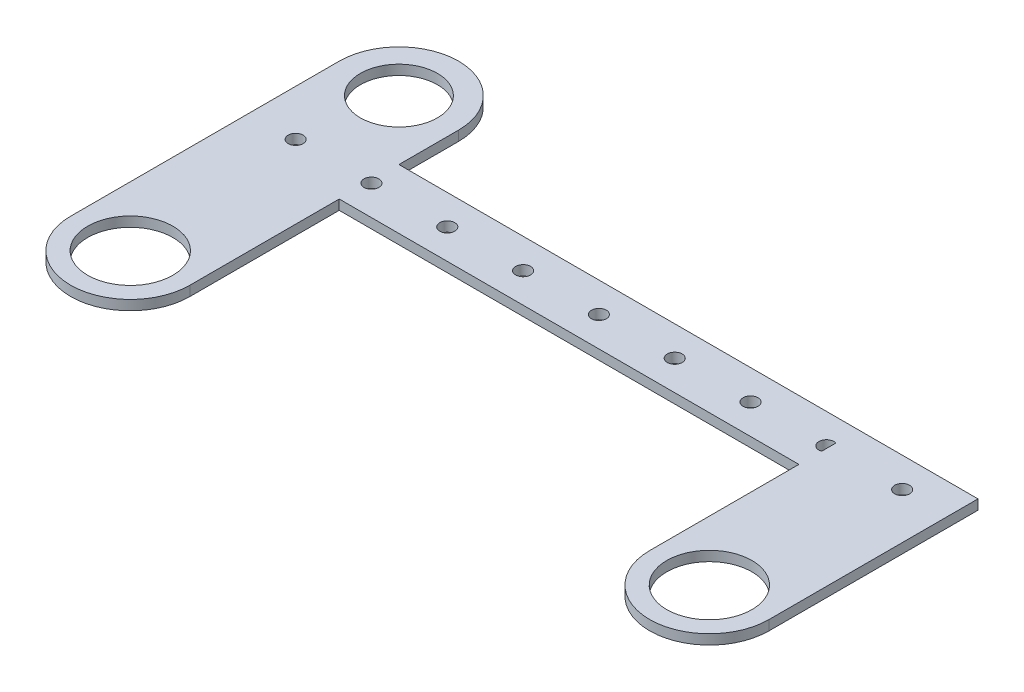
ISO-10303-21;
HEADER;
FILE_DESCRIPTION(('STEP AP214'),'2;1');
FILE_NAME('part.step','',(''),(''),'','','');
FILE_SCHEMA(('AUTOMOTIVE_DESIGN { 1 0 10303 214 1 1 1 1 }'));
ENDSEC;
DATA;
#1=APPLICATION_CONTEXT('core data for automotive mechanical design processes');
#2=APPLICATION_PROTOCOL_DEFINITION('international standard','automotive_design',2000,#1);
#3=PRODUCT_CONTEXT('',#1,'mechanical');
#4=PRODUCT('Part','Part','',(#3));
#5=PRODUCT_RELATED_PRODUCT_CATEGORY('part','',(#4));
#6=PRODUCT_DEFINITION_FORMATION('','',#4);
#7=PRODUCT_DEFINITION_CONTEXT('part definition',#1,'design');
#8=PRODUCT_DEFINITION('design','',#6,#7);
#9=PRODUCT_DEFINITION_SHAPE('','',#8);
#10=(LENGTH_UNIT() NAMED_UNIT(*) SI_UNIT(.MILLI.,.METRE.));
#11=(NAMED_UNIT(*) PLANE_ANGLE_UNIT() SI_UNIT($,.RADIAN.));
#12=(NAMED_UNIT(*) SI_UNIT($,.STERADIAN.) SOLID_ANGLE_UNIT());
#13=UNCERTAINTY_MEASURE_WITH_UNIT(LENGTH_MEASURE(1.E-05),#10,'distance_accuracy_value','');
#14=(GEOMETRIC_REPRESENTATION_CONTEXT(3) GLOBAL_UNCERTAINTY_ASSIGNED_CONTEXT((#13)) GLOBAL_UNIT_ASSIGNED_CONTEXT((#10,
#11,#12)) REPRESENTATION_CONTEXT('',''));
#15=CARTESIAN_POINT('',(0.,0.,0.));
#16=DIRECTION('',(0.,0.,1.));
#17=DIRECTION('',(1.,0.,0.));
#18=AXIS2_PLACEMENT_3D('',#15,#16,#17);
#19=CARTESIAN_POINT('',(-117.,3.3,0.));
#20=DIRECTION('',(1.,0.,0.));
#21=DIRECTION('',(0.,0.,-1.));
#22=AXIS2_PLACEMENT_3D('',#19,#20,#21);
#23=PLANE('',#22);
#24=DIRECTION('',(0.,0.,1.));
#25=VECTOR('',#24,1.);
#26=CARTESIAN_POINT('',(-117.,0.,0.));
#27=LINE('',#26,#25);
#28=CARTESIAN_POINT('',(-117.,0.,-30.));
#29=VERTEX_POINT('',#28);
#30=CARTESIAN_POINT('',(-117.,0.,60.));
#31=VERTEX_POINT('',#30);
#32=EDGE_CURVE('E203',#29,#31,#27,.T.);
#33=ORIENTED_EDGE('',*,*,#32,.T.);
#34=DIRECTION('',(0.,-1.,0.));
#35=VECTOR('',#34,1.);
#36=CARTESIAN_POINT('',(-117.,3.3,60.));
#37=LINE('',#36,#35);
#38=CARTESIAN_POINT('',(-117.,3.3,60.));
#39=VERTEX_POINT('',#38);
#40=EDGE_CURVE('E11',#39,#31,#37,.T.);
#41=ORIENTED_EDGE('',*,*,#40,.F.);
#42=DIRECTION('',(0.,0.,1.));
#43=VECTOR('',#42,1.);
#44=CARTESIAN_POINT('',(-117.,3.3,0.));
#45=LINE('',#44,#43);
#46=CARTESIAN_POINT('',(-117.,3.3,-30.));
#47=VERTEX_POINT('',#46);
#48=EDGE_CURVE('E329',#47,#39,#45,.T.);
#49=ORIENTED_EDGE('',*,*,#48,.F.);
#50=DIRECTION('',(0.,-1.,0.));
#51=VECTOR('',#50,1.);
#52=CARTESIAN_POINT('',(-117.,59.8685424949238,-30.));
#53=LINE('',#52,#51);
#54=EDGE_CURVE('E337',#47,#29,#53,.T.);
#55=ORIENTED_EDGE('',*,*,#54,.T.);
#56=EDGE_LOOP('',(#33,#41,#49,#55));
#57=FACE_BOUND('',#56,.T.);
#58=ADVANCED_FACE('F45',(#57),#23,.F.);
#59=CARTESIAN_POINT('',(-97.,3.3,60.));
#60=DIRECTION('',(0.,-1.,0.));
#61=DIRECTION('',(0.,0.,-1.));
#62=AXIS2_PLACEMENT_3D('',#59,#60,#61);
#63=CYLINDRICAL_SURFACE('',#62,20.);
#64=CARTESIAN_POINT('',(-97.,0.,60.));
#65=DIRECTION('',(0.,1.,0.));
#66=DIRECTION('',(0.,0.,1.));
#67=AXIS2_PLACEMENT_3D('',#64,#65,#66);
#68=CIRCLE('',#67,20.);
#69=CARTESIAN_POINT('',(-77.,0.,60.));
#70=VERTEX_POINT('',#69);
#71=EDGE_CURVE('E206',#31,#70,#68,.T.);
#72=ORIENTED_EDGE('',*,*,#71,.T.);
#73=DIRECTION('',(0.,-1.,0.));
#74=VECTOR('',#73,1.);
#75=CARTESIAN_POINT('',(-77.,3.3,60.));
#76=LINE('',#75,#74);
#77=CARTESIAN_POINT('',(-77.,3.3,60.));
#78=VERTEX_POINT('',#77);
#79=EDGE_CURVE('E54',#78,#70,#76,.T.);
#80=ORIENTED_EDGE('',*,*,#79,.F.);
#81=CARTESIAN_POINT('',(-97.,3.3,60.));
#82=DIRECTION('',(0.,1.,0.));
#83=DIRECTION('',(0.,0.,1.));
#84=AXIS2_PLACEMENT_3D('',#81,#82,#83);
#85=CIRCLE('',#84,20.);
#86=EDGE_CURVE('E327',#39,#78,#85,.T.);
#87=ORIENTED_EDGE('',*,*,#86,.F.);
#88=ORIENTED_EDGE('',*,*,#40,.T.);
#89=EDGE_LOOP('',(#72,#80,#87,#88));
#90=FACE_BOUND('',#89,.T.);
#91=ADVANCED_FACE('F279',(#90),#63,.T.);
#92=CARTESIAN_POINT('',(-77.,3.3,0.));
#93=DIRECTION('',(1.,0.,0.));
#94=DIRECTION('',(0.,0.,-1.));
#95=AXIS2_PLACEMENT_3D('',#92,#93,#94);
#96=PLANE('',#95);
#97=DIRECTION('',(0.,0.,1.));
#98=VECTOR('',#97,1.);
#99=CARTESIAN_POINT('',(-77.,0.,0.));
#100=LINE('',#99,#98);
#101=CARTESIAN_POINT('',(-77.,0.,10.));
#102=VERTEX_POINT('',#101);
#103=EDGE_CURVE('E209',#102,#70,#100,.T.);
#104=ORIENTED_EDGE('',*,*,#103,.F.);
#105=DIRECTION('',(0.,-1.,0.));
#106=VECTOR('',#105,1.);
#107=CARTESIAN_POINT('',(-77.,3.3,10.));
#108=LINE('',#107,#106);
#109=CARTESIAN_POINT('',(-77.,3.3,10.));
#110=VERTEX_POINT('',#109);
#111=EDGE_CURVE('E256',#110,#102,#108,.T.);
#112=ORIENTED_EDGE('',*,*,#111,.F.);
#113=DIRECTION('',(0.,0.,1.));
#114=VECTOR('',#113,1.);
#115=CARTESIAN_POINT('',(-77.,3.3,0.));
#116=LINE('',#115,#114);
#117=EDGE_CURVE('E326',#110,#78,#116,.T.);
#118=ORIENTED_EDGE('',*,*,#117,.T.);
#119=ORIENTED_EDGE('',*,*,#79,.T.);
#120=EDGE_LOOP('',(#104,#112,#118,#119));
#121=FACE_BOUND('',#120,.T.);
#122=ADVANCED_FACE('F287',(#121),#96,.T.);
#123=CARTESIAN_POINT('',(0.,3.3,10.));
#124=DIRECTION('',(0.,0.,-1.));
#125=DIRECTION('',(-1.,0.,0.));
#126=AXIS2_PLACEMENT_3D('',#123,#124,#125);
#127=PLANE('',#126);
#128=DIRECTION('',(1.,0.,0.));
#129=VECTOR('',#128,1.);
#130=CARTESIAN_POINT('',(0.,0.,10.));
#131=LINE('',#130,#129);
#132=CARTESIAN_POINT('',(77.,0.,10.));
#133=VERTEX_POINT('',#132);
#134=EDGE_CURVE('E212',#102,#133,#131,.T.);
#135=ORIENTED_EDGE('',*,*,#134,.T.);
#136=DIRECTION('',(0.,-1.,0.));
#137=VECTOR('',#136,1.);
#138=CARTESIAN_POINT('',(77.,3.3,10.));
#139=LINE('',#138,#137);
#140=CARTESIAN_POINT('',(77.,3.3,10.));
#141=VERTEX_POINT('',#140);
#142=EDGE_CURVE('E154',#141,#133,#139,.T.);
#143=ORIENTED_EDGE('',*,*,#142,.F.);
#144=DIRECTION('',(1.,0.,0.));
#145=VECTOR('',#144,1.);
#146=CARTESIAN_POINT('',(0.,3.3,10.));
#147=LINE('',#146,#145);
#148=EDGE_CURVE('E141',#110,#141,#147,.T.);
#149=ORIENTED_EDGE('',*,*,#148,.F.);
#150=ORIENTED_EDGE('',*,*,#111,.T.);
#151=EDGE_LOOP('',(#135,#143,#149,#150));
#152=FACE_BOUND('',#151,.T.);
#153=ADVANCED_FACE('F313',(#152),#127,.F.);
#154=CARTESIAN_POINT('',(77.,3.3,0.));
#155=DIRECTION('',(1.,0.,0.));
#156=DIRECTION('',(0.,0.,-1.));
#157=AXIS2_PLACEMENT_3D('',#154,#155,#156);
#158=PLANE('',#157);
#159=DIRECTION('',(0.,0.,1.));
#160=VECTOR('',#159,1.);
#161=CARTESIAN_POINT('',(77.,0.,0.));
#162=LINE('',#161,#160);
#163=CARTESIAN_POINT('',(77.,0.,60.));
#164=VERTEX_POINT('',#163);
#165=EDGE_CURVE('E150',#133,#164,#162,.T.);
#166=ORIENTED_EDGE('',*,*,#165,.T.);
#167=DIRECTION('',(0.,-1.,0.));
#168=VECTOR('',#167,1.);
#169=CARTESIAN_POINT('',(77.,3.3,60.));
#170=LINE('',#169,#168);
#171=CARTESIAN_POINT('',(77.,3.3,60.));
#172=VERTEX_POINT('',#171);
#173=EDGE_CURVE('E147',#172,#164,#170,.T.);
#174=ORIENTED_EDGE('',*,*,#173,.F.);
#175=DIRECTION('',(0.,0.,1.));
#176=VECTOR('',#175,1.);
#177=CARTESIAN_POINT('',(77.,3.3,0.));
#178=LINE('',#177,#176);
#179=EDGE_CURVE('E132',#141,#172,#178,.T.);
#180=ORIENTED_EDGE('',*,*,#179,.F.);
#181=ORIENTED_EDGE('',*,*,#142,.T.);
#182=EDGE_LOOP('',(#166,#174,#180,#181));
#183=FACE_BOUND('',#182,.T.);
#184=ADVANCED_FACE('F148',(#183),#158,.F.);
#185=CARTESIAN_POINT('',(97.,3.3,60.));
#186=DIRECTION('',(0.,-1.,0.));
#187=DIRECTION('',(0.,0.,-1.));
#188=AXIS2_PLACEMENT_3D('',#185,#186,#187);
#189=CYLINDRICAL_SURFACE('',#188,20.);
#190=CARTESIAN_POINT('',(97.,0.,60.));
#191=DIRECTION('',(0.,1.,0.));
#192=DIRECTION('',(0.,0.,1.));
#193=AXIS2_PLACEMENT_3D('',#190,#191,#192);
#194=CIRCLE('',#193,20.);
#195=CARTESIAN_POINT('',(117.,0.,60.));
#196=VERTEX_POINT('',#195);
#197=EDGE_CURVE('E215',#196,#164,#194,.F.);
#198=ORIENTED_EDGE('',*,*,#197,.F.);
#199=DIRECTION('',(0.,-1.,0.));
#200=VECTOR('',#199,1.);
#201=CARTESIAN_POINT('',(117.,3.3,60.));
#202=LINE('',#201,#200);
#203=CARTESIAN_POINT('',(117.,3.3,60.));
#204=VERTEX_POINT('',#203);
#205=EDGE_CURVE('E155',#204,#196,#202,.T.);
#206=ORIENTED_EDGE('',*,*,#205,.F.);
#207=CARTESIAN_POINT('',(97.,3.3,60.));
#208=DIRECTION('',(0.,1.,0.));
#209=DIRECTION('',(0.,0.,1.));
#210=AXIS2_PLACEMENT_3D('',#207,#208,#209);
#211=CIRCLE('',#210,20.);
#212=EDGE_CURVE('E138',#204,#172,#211,.F.);
#213=ORIENTED_EDGE('',*,*,#212,.T.);
#214=ORIENTED_EDGE('',*,*,#173,.T.);
#215=EDGE_LOOP('',(#198,#206,#213,#214));
#216=FACE_BOUND('',#215,.T.);
#217=ADVANCED_FACE('F157',(#216),#189,.T.);
#218=CARTESIAN_POINT('',(117.,3.3,0.));
#219=DIRECTION('',(-1.,0.,0.));
#220=DIRECTION('',(0.,0.,1.));
#221=AXIS2_PLACEMENT_3D('',#218,#219,#220);
#222=PLANE('',#221);
#223=DIRECTION('',(0.,0.,-1.));
#224=VECTOR('',#223,1.);
#225=CARTESIAN_POINT('',(117.,0.,0.));
#226=LINE('',#225,#224);
#227=CARTESIAN_POINT('',(117.,0.,-10.));
#228=VERTEX_POINT('',#227);
#229=EDGE_CURVE('E217',#196,#228,#226,.T.);
#230=ORIENTED_EDGE('',*,*,#229,.T.);
#231=DIRECTION('',(0.,-1.,0.));
#232=VECTOR('',#231,1.);
#233=CARTESIAN_POINT('',(117.,3.3,-10.));
#234=LINE('',#233,#232);
#235=CARTESIAN_POINT('',(117.,3.3,-10.));
#236=VERTEX_POINT('',#235);
#237=EDGE_CURVE('E252',#236,#228,#234,.T.);
#238=ORIENTED_EDGE('',*,*,#237,.F.);
#239=DIRECTION('',(0.,0.,-1.));
#240=VECTOR('',#239,1.);
#241=CARTESIAN_POINT('',(117.,3.3,0.));
#242=LINE('',#241,#240);
#243=EDGE_CURVE('E159',#204,#236,#242,.T.);
#244=ORIENTED_EDGE('',*,*,#243,.F.);
#245=ORIENTED_EDGE('',*,*,#205,.T.);
#246=EDGE_LOOP('',(#230,#238,#244,#245));
#247=FACE_BOUND('',#246,.T.);
#248=ADVANCED_FACE('F268',(#247),#222,.F.);
#249=CARTESIAN_POINT('',(76.2,3.3,0.));
#250=DIRECTION('',(0.,-1.,0.));
#251=DIRECTION('',(0.,0.,-1.));
#252=AXIS2_PLACEMENT_3D('',#249,#250,#251);
#253=CYLINDRICAL_SURFACE('',#252,2.5);
#254=CARTESIAN_POINT('',(76.2,0.,0.));
#255=DIRECTION('',(0.,1.,0.));
#256=DIRECTION('',(0.,0.,1.));
#257=AXIS2_PLACEMENT_3D('',#254,#255,#256);
#258=CIRCLE('',#257,2.5);
#259=CARTESIAN_POINT('',(77.,0.,-2.36854385646539));
#260=VERTEX_POINT('',#259);
#261=CARTESIAN_POINT('',(77.,0.,2.36854385646539));
#262=VERTEX_POINT('',#261);
#263=EDGE_CURVE('E196',#260,#262,#258,.T.);
#264=ORIENTED_EDGE('',*,*,#263,.F.);
#265=DIRECTION('',(0.,-1.,0.));
#266=VECTOR('',#265,1.);
#267=CARTESIAN_POINT('',(77.,3.3,-2.36854385646539));
#268=LINE('',#267,#266);
#269=CARTESIAN_POINT('',(77.,3.3,-2.36854385646539));
#270=VERTEX_POINT('',#269);
#271=EDGE_CURVE('E49',#270,#260,#268,.T.);
#272=ORIENTED_EDGE('',*,*,#271,.F.);
#273=CARTESIAN_POINT('',(76.2,3.3,0.));
#274=DIRECTION('',(0.,1.,0.));
#275=DIRECTION('',(0.,0.,1.));
#276=AXIS2_PLACEMENT_3D('',#273,#274,#275);
#277=CIRCLE('',#276,2.5);
#278=CARTESIAN_POINT('',(77.,3.3,2.36854385646539));
#279=VERTEX_POINT('',#278);
#280=EDGE_CURVE('E251',#270,#279,#277,.T.);
#281=ORIENTED_EDGE('',*,*,#280,.T.);
#282=DIRECTION('',(0.,-1.,0.));
#283=VECTOR('',#282,1.);
#284=CARTESIAN_POINT('',(77.,3.3,2.36854385646539));
#285=LINE('',#284,#283);
#286=EDGE_CURVE('E195',#279,#262,#285,.T.);
#287=ORIENTED_EDGE('',*,*,#286,.T.);
#288=EDGE_LOOP('',(#264,#272,#281,#287));
#289=FACE_BOUND('',#288,.T.);
#290=ADVANCED_FACE('F47',(#289),#253,.F.);
#291=CARTESIAN_POINT('',(101.6,3.3,0.));
#292=DIRECTION('',(0.,-1.,0.));
#293=DIRECTION('',(0.,0.,-1.));
#294=AXIS2_PLACEMENT_3D('',#291,#292,#293);
#295=CYLINDRICAL_SURFACE('',#294,2.5);
#296=CARTESIAN_POINT('',(101.6,3.3,0.));
#297=DIRECTION('',(0.,1.,0.));
#298=DIRECTION('',(0.,0.,1.));
#299=AXIS2_PLACEMENT_3D('',#296,#297,#298);
#300=CIRCLE('',#299,2.5);
#301=CARTESIAN_POINT('',(101.6,3.3,2.5));
#302=VERTEX_POINT('',#301);
#303=EDGE_CURVE('E189',#302,#302,#300,.T.);
#304=ORIENTED_EDGE('',*,*,#303,.T.);
#305=EDGE_LOOP('',(#304));
#306=FACE_BOUND('',#305,.T.);
#307=CARTESIAN_POINT('',(101.6,0.,0.));
#308=DIRECTION('',(0.,1.,0.));
#309=DIRECTION('',(0.,0.,1.));
#310=AXIS2_PLACEMENT_3D('',#307,#308,#309);
#311=CIRCLE('',#310,2.5);
#312=CARTESIAN_POINT('',(101.6,0.,2.5));
#313=VERTEX_POINT('',#312);
#314=EDGE_CURVE('E245',#313,#313,#311,.T.);
#315=ORIENTED_EDGE('',*,*,#314,.F.);
#316=EDGE_LOOP('',(#315));
#317=FACE_BOUND('',#316,.T.);
#318=ADVANCED_FACE('F267',(#306,#317),#295,.F.);
#319=CARTESIAN_POINT('',(-97.,3.3,60.));
#320=DIRECTION('',(0.,-1.,0.));
#321=DIRECTION('',(0.,0.,-1.));
#322=AXIS2_PLACEMENT_3D('',#319,#320,#321);
#323=CYLINDRICAL_SURFACE('',#322,14.26);
#324=CARTESIAN_POINT('',(-97.,3.3,60.));
#325=DIRECTION('',(0.,1.,0.));
#326=DIRECTION('',(0.,0.,1.));
#327=AXIS2_PLACEMENT_3D('',#324,#325,#326);
#328=CIRCLE('',#327,14.26);
#329=CARTESIAN_POINT('',(-97.,3.3,74.26));
#330=VERTEX_POINT('',#329);
#331=EDGE_CURVE('E186',#330,#330,#328,.T.);
#332=ORIENTED_EDGE('',*,*,#331,.T.);
#333=EDGE_LOOP('',(#332));
#334=FACE_BOUND('',#333,.T.);
#335=CARTESIAN_POINT('',(-97.,0.,60.));
#336=DIRECTION('',(0.,1.,0.));
#337=DIRECTION('',(0.,0.,1.));
#338=AXIS2_PLACEMENT_3D('',#335,#336,#337);
#339=CIRCLE('',#338,14.26);
#340=CARTESIAN_POINT('',(-97.,0.,74.26));
#341=VERTEX_POINT('',#340);
#342=EDGE_CURVE('E242',#341,#341,#339,.T.);
#343=ORIENTED_EDGE('',*,*,#342,.F.);
#344=EDGE_LOOP('',(#343));
#345=FACE_BOUND('',#344,.T.);
#346=ADVANCED_FACE('F273',(#334,#345),#323,.F.);
#347=CARTESIAN_POINT('',(0.,3.3,0.));
#348=DIRECTION('',(0.,-1.,0.));
#349=DIRECTION('',(0.,0.,-1.));
#350=AXIS2_PLACEMENT_3D('',#347,#348,#349);
#351=CYLINDRICAL_SURFACE('',#350,2.5);
#352=CARTESIAN_POINT('',(0.,3.3,0.));
#353=DIRECTION('',(0.,1.,0.));
#354=DIRECTION('',(0.,0.,1.));
#355=AXIS2_PLACEMENT_3D('',#352,#353,#354);
#356=CIRCLE('',#355,2.5);
#357=CARTESIAN_POINT('',(0.,3.3,2.5));
#358=VERTEX_POINT('',#357);
#359=EDGE_CURVE('E183',#358,#358,#356,.T.);
#360=ORIENTED_EDGE('',*,*,#359,.T.);
#361=EDGE_LOOP('',(#360));
#362=FACE_BOUND('',#361,.T.);
#363=CARTESIAN_POINT('',(0.,0.,0.));
#364=DIRECTION('',(0.,1.,0.));
#365=DIRECTION('',(0.,0.,1.));
#366=AXIS2_PLACEMENT_3D('',#363,#364,#365);
#367=CIRCLE('',#366,2.5);
#368=CARTESIAN_POINT('',(0.,0.,2.5));
#369=VERTEX_POINT('',#368);
#370=EDGE_CURVE('E239',#369,#369,#367,.T.);
#371=ORIENTED_EDGE('',*,*,#370,.F.);
#372=EDGE_LOOP('',(#371));
#373=FACE_BOUND('',#372,.T.);
#374=ADVANCED_FACE('F394',(#362,#373),#351,.F.);
#375=CARTESIAN_POINT('',(25.4,3.3,0.));
#376=DIRECTION('',(0.,-1.,0.));
#377=DIRECTION('',(0.,0.,-1.));
#378=AXIS2_PLACEMENT_3D('',#375,#376,#377);
#379=CYLINDRICAL_SURFACE('',#378,2.5);
#380=CARTESIAN_POINT('',(25.4,3.3,0.));
#381=DIRECTION('',(0.,1.,0.));
#382=DIRECTION('',(0.,0.,1.));
#383=AXIS2_PLACEMENT_3D('',#380,#381,#382);
#384=CIRCLE('',#383,2.5);
#385=CARTESIAN_POINT('',(25.4,3.3,2.5));
#386=VERTEX_POINT('',#385);
#387=EDGE_CURVE('E180',#386,#386,#384,.T.);
#388=ORIENTED_EDGE('',*,*,#387,.T.);
#389=EDGE_LOOP('',(#388));
#390=FACE_BOUND('',#389,.T.);
#391=CARTESIAN_POINT('',(25.4,0.,0.));
#392=DIRECTION('',(0.,1.,0.));
#393=DIRECTION('',(0.,0.,1.));
#394=AXIS2_PLACEMENT_3D('',#391,#392,#393);
#395=CIRCLE('',#394,2.5);
#396=CARTESIAN_POINT('',(25.4,0.,2.5));
#397=VERTEX_POINT('',#396);
#398=EDGE_CURVE('E236',#397,#397,#395,.T.);
#399=ORIENTED_EDGE('',*,*,#398,.F.);
#400=EDGE_LOOP('',(#399));
#401=FACE_BOUND('',#400,.T.);
#402=ADVANCED_FACE('F398',(#390,#401),#379,.F.);
#403=CARTESIAN_POINT('',(50.8,3.3,0.));
#404=DIRECTION('',(0.,-1.,0.));
#405=DIRECTION('',(0.,0.,-1.));
#406=AXIS2_PLACEMENT_3D('',#403,#404,#405);
#407=CYLINDRICAL_SURFACE('',#406,2.5);
#408=CARTESIAN_POINT('',(50.8,3.3,0.));
#409=DIRECTION('',(0.,1.,0.));
#410=DIRECTION('',(0.,0.,1.));
#411=AXIS2_PLACEMENT_3D('',#408,#409,#410);
#412=CIRCLE('',#411,2.5);
#413=CARTESIAN_POINT('',(50.8,3.3,2.5));
#414=VERTEX_POINT('',#413);
#415=EDGE_CURVE('E177',#414,#414,#412,.T.);
#416=ORIENTED_EDGE('',*,*,#415,.T.);
#417=EDGE_LOOP('',(#416));
#418=FACE_BOUND('',#417,.T.);
#419=CARTESIAN_POINT('',(50.8,0.,0.));
#420=DIRECTION('',(0.,1.,0.));
#421=DIRECTION('',(0.,0.,1.));
#422=AXIS2_PLACEMENT_3D('',#419,#420,#421);
#423=CIRCLE('',#422,2.5);
#424=CARTESIAN_POINT('',(50.8,0.,2.5));
#425=VERTEX_POINT('',#424);
#426=EDGE_CURVE('E233',#425,#425,#423,.T.);
#427=ORIENTED_EDGE('',*,*,#426,.F.);
#428=EDGE_LOOP('',(#427));
#429=FACE_BOUND('',#428,.T.);
#430=ADVANCED_FACE('F402',(#418,#429),#407,.F.);
#431=CARTESIAN_POINT('',(-25.4,3.3,0.));
#432=DIRECTION('',(0.,-1.,0.));
#433=DIRECTION('',(0.,0.,-1.));
#434=AXIS2_PLACEMENT_3D('',#431,#432,#433);
#435=CYLINDRICAL_SURFACE('',#434,2.5);
#436=CARTESIAN_POINT('',(-25.4,3.3,0.));
#437=DIRECTION('',(0.,1.,0.));
#438=DIRECTION('',(0.,0.,1.));
#439=AXIS2_PLACEMENT_3D('',#436,#437,#438);
#440=CIRCLE('',#439,2.5);
#441=CARTESIAN_POINT('',(-25.4,3.3,2.5));
#442=VERTEX_POINT('',#441);
#443=EDGE_CURVE('E174',#442,#442,#440,.T.);
#444=ORIENTED_EDGE('',*,*,#443,.T.);
#445=EDGE_LOOP('',(#444));
#446=FACE_BOUND('',#445,.T.);
#447=CARTESIAN_POINT('',(-25.4,0.,0.));
#448=DIRECTION('',(0.,1.,0.));
#449=DIRECTION('',(0.,0.,1.));
#450=AXIS2_PLACEMENT_3D('',#447,#448,#449);
#451=CIRCLE('',#450,2.5);
#452=CARTESIAN_POINT('',(-25.4,0.,2.5));
#453=VERTEX_POINT('',#452);
#454=EDGE_CURVE('E230',#453,#453,#451,.T.);
#455=ORIENTED_EDGE('',*,*,#454,.F.);
#456=EDGE_LOOP('',(#455));
#457=FACE_BOUND('',#456,.T.);
#458=ADVANCED_FACE('F406',(#446,#457),#435,.F.);
#459=CARTESIAN_POINT('',(-50.8,3.3,0.));
#460=DIRECTION('',(0.,-1.,0.));
#461=DIRECTION('',(0.,0.,-1.));
#462=AXIS2_PLACEMENT_3D('',#459,#460,#461);
#463=CYLINDRICAL_SURFACE('',#462,2.5);
#464=CARTESIAN_POINT('',(-50.8,3.3,0.));
#465=DIRECTION('',(0.,1.,0.));
#466=DIRECTION('',(0.,0.,1.));
#467=AXIS2_PLACEMENT_3D('',#464,#465,#466);
#468=CIRCLE('',#467,2.5);
#469=CARTESIAN_POINT('',(-50.8,3.3,2.5));
#470=VERTEX_POINT('',#469);
#471=EDGE_CURVE('E171',#470,#470,#468,.T.);
#472=ORIENTED_EDGE('',*,*,#471,.T.);
#473=EDGE_LOOP('',(#472));
#474=FACE_BOUND('',#473,.T.);
#475=CARTESIAN_POINT('',(-50.8,0.,0.));
#476=DIRECTION('',(0.,1.,0.));
#477=DIRECTION('',(0.,0.,1.));
#478=AXIS2_PLACEMENT_3D('',#475,#476,#477);
#479=CIRCLE('',#478,2.5);
#480=CARTESIAN_POINT('',(-50.8,0.,2.5));
#481=VERTEX_POINT('',#480);
#482=EDGE_CURVE('E227',#481,#481,#479,.T.);
#483=ORIENTED_EDGE('',*,*,#482,.F.);
#484=EDGE_LOOP('',(#483));
#485=FACE_BOUND('',#484,.T.);
#486=ADVANCED_FACE('F410',(#474,#485),#463,.F.);
#487=CARTESIAN_POINT('',(-76.2,3.3,0.));
#488=DIRECTION('',(0.,-1.,0.));
#489=DIRECTION('',(0.,0.,-1.));
#490=AXIS2_PLACEMENT_3D('',#487,#488,#489);
#491=CYLINDRICAL_SURFACE('',#490,2.5);
#492=CARTESIAN_POINT('',(-76.2,3.3,0.));
#493=DIRECTION('',(0.,1.,0.));
#494=DIRECTION('',(0.,0.,1.));
#495=AXIS2_PLACEMENT_3D('',#492,#493,#494);
#496=CIRCLE('',#495,2.5);
#497=CARTESIAN_POINT('',(-76.2,3.3,2.5));
#498=VERTEX_POINT('',#497);
#499=EDGE_CURVE('E168',#498,#498,#496,.T.);
#500=ORIENTED_EDGE('',*,*,#499,.T.);
#501=EDGE_LOOP('',(#500));
#502=FACE_BOUND('',#501,.T.);
#503=CARTESIAN_POINT('',(-76.2,0.,0.));
#504=DIRECTION('',(0.,1.,0.));
#505=DIRECTION('',(0.,0.,1.));
#506=AXIS2_PLACEMENT_3D('',#503,#504,#505);
#507=CIRCLE('',#506,2.5);
#508=CARTESIAN_POINT('',(-76.2,0.,2.5));
#509=VERTEX_POINT('',#508);
#510=EDGE_CURVE('E224',#509,#509,#507,.T.);
#511=ORIENTED_EDGE('',*,*,#510,.F.);
#512=EDGE_LOOP('',(#511));
#513=FACE_BOUND('',#512,.T.);
#514=ADVANCED_FACE('F304',(#502,#513),#491,.F.);
#515=CARTESIAN_POINT('',(-101.6,3.3,0.));
#516=DIRECTION('',(0.,-1.,0.));
#517=DIRECTION('',(0.,0.,-1.));
#518=AXIS2_PLACEMENT_3D('',#515,#516,#517);
#519=CYLINDRICAL_SURFACE('',#518,2.5);
#520=CARTESIAN_POINT('',(-101.6,3.3,0.));
#521=DIRECTION('',(0.,1.,0.));
#522=DIRECTION('',(0.,0.,1.));
#523=AXIS2_PLACEMENT_3D('',#520,#521,#522);
#524=CIRCLE('',#523,2.5);
#525=CARTESIAN_POINT('',(-101.6,3.3,2.5));
#526=VERTEX_POINT('',#525);
#527=EDGE_CURVE('E165',#526,#526,#524,.T.);
#528=ORIENTED_EDGE('',*,*,#527,.T.);
#529=EDGE_LOOP('',(#528));
#530=FACE_BOUND('',#529,.T.);
#531=CARTESIAN_POINT('',(-101.6,0.,0.));
#532=DIRECTION('',(0.,1.,0.));
#533=DIRECTION('',(0.,0.,1.));
#534=AXIS2_PLACEMENT_3D('',#531,#532,#533);
#535=CIRCLE('',#534,2.5);
#536=CARTESIAN_POINT('',(-101.6,0.,2.5));
#537=VERTEX_POINT('',#536);
#538=EDGE_CURVE('E221',#537,#537,#535,.T.);
#539=ORIENTED_EDGE('',*,*,#538,.F.);
#540=EDGE_LOOP('',(#539));
#541=FACE_BOUND('',#540,.T.);
#542=ADVANCED_FACE('F299',(#530,#541),#519,.F.);
#543=CARTESIAN_POINT('',(0.,3.3,-10.));
#544=DIRECTION('',(0.,0.,-1.));
#545=DIRECTION('',(-1.,0.,0.));
#546=AXIS2_PLACEMENT_3D('',#543,#544,#545);
#547=PLANE('',#546);
#548=DIRECTION('',(0.,-1.,0.));
#549=VECTOR('',#548,1.);
#550=CARTESIAN_POINT('',(-77.,59.8685424949238,-10.));
#551=LINE('',#550,#549);
#552=CARTESIAN_POINT('',(-77.,3.3,-10.));
#553=VERTEX_POINT('',#552);
#554=CARTESIAN_POINT('',(-77.,0.,-10.));
#555=VERTEX_POINT('',#554);
#556=EDGE_CURVE('E62',#553,#555,#551,.T.);
#557=ORIENTED_EDGE('',*,*,#556,.F.);
#558=DIRECTION('',(1.,0.,0.));
#559=VECTOR('',#558,1.);
#560=CARTESIAN_POINT('',(0.,3.3,-10.));
#561=LINE('',#560,#559);
#562=EDGE_CURVE('E67',#553,#236,#561,.T.);
#563=ORIENTED_EDGE('',*,*,#562,.T.);
#564=ORIENTED_EDGE('',*,*,#237,.T.);
#565=DIRECTION('',(1.,0.,0.));
#566=VECTOR('',#565,1.);
#567=CARTESIAN_POINT('',(0.,0.,-10.));
#568=LINE('',#567,#566);
#569=EDGE_CURVE('E104',#555,#228,#568,.T.);
#570=ORIENTED_EDGE('',*,*,#569,.F.);
#571=EDGE_LOOP('',(#557,#563,#564,#570));
#572=FACE_BOUND('',#571,.T.);
#573=ADVANCED_FACE('F293',(#572),#547,.T.);
#574=CARTESIAN_POINT('',(77.,3.3,0.));
#575=DIRECTION('',(1.,0.,0.));
#576=DIRECTION('',(0.,0.,-1.));
#577=AXIS2_PLACEMENT_3D('',#574,#575,#576);
#578=PLANE('',#577);
#579=DIRECTION('',(0.,0.,1.));
#580=VECTOR('',#579,1.);
#581=CARTESIAN_POINT('',(77.,0.,0.));
#582=LINE('',#581,#580);
#583=EDGE_CURVE('E199',#260,#262,#582,.T.);
#584=ORIENTED_EDGE('',*,*,#583,.T.);
#585=ORIENTED_EDGE('',*,*,#286,.F.);
#586=DIRECTION('',(0.,0.,1.));
#587=VECTOR('',#586,1.);
#588=CARTESIAN_POINT('',(77.,3.3,0.));
#589=LINE('',#588,#587);
#590=EDGE_CURVE('E262',#270,#279,#589,.T.);
#591=ORIENTED_EDGE('',*,*,#590,.F.);
#592=ORIENTED_EDGE('',*,*,#271,.T.);
#593=EDGE_LOOP('',(#584,#585,#591,#592));
#594=FACE_BOUND('',#593,.T.);
#595=ADVANCED_FACE('F261',(#594),#578,.F.);
#596=CARTESIAN_POINT('',(97.,3.3,60.));
#597=DIRECTION('',(0.,-1.,0.));
#598=DIRECTION('',(0.,0.,-1.));
#599=AXIS2_PLACEMENT_3D('',#596,#597,#598);
#600=CYLINDRICAL_SURFACE('',#599,14.26);
#601=CARTESIAN_POINT('',(97.,3.3,60.));
#602=DIRECTION('',(0.,1.,0.));
#603=DIRECTION('',(0.,0.,1.));
#604=AXIS2_PLACEMENT_3D('',#601,#602,#603);
#605=CIRCLE('',#604,14.26);
#606=CARTESIAN_POINT('',(97.,3.3,74.26));
#607=VERTEX_POINT('',#606);
#608=EDGE_CURVE('E192',#607,#607,#605,.F.);
#609=ORIENTED_EDGE('',*,*,#608,.F.);
#610=EDGE_LOOP('',(#609));
#611=FACE_BOUND('',#610,.T.);
#612=CARTESIAN_POINT('',(97.,0.,60.));
#613=DIRECTION('',(0.,1.,0.));
#614=DIRECTION('',(0.,0.,1.));
#615=AXIS2_PLACEMENT_3D('',#612,#613,#614);
#616=CIRCLE('',#615,14.26);
#617=CARTESIAN_POINT('',(97.,0.,74.26));
#618=VERTEX_POINT('',#617);
#619=EDGE_CURVE('E248',#618,#618,#616,.F.);
#620=ORIENTED_EDGE('',*,*,#619,.T.);
#621=EDGE_LOOP('',(#620));
#622=FACE_BOUND('',#621,.T.);
#623=ADVANCED_FACE('F292',(#611,#622),#600,.F.);
#624=CARTESIAN_POINT('',(0.,3.3,0.));
#625=DIRECTION('',(0.,1.,0.));
#626=DIRECTION('',(0.,0.,1.));
#627=AXIS2_PLACEMENT_3D('',#624,#625,#626);
#628=PLANE('',#627);
#629=ORIENTED_EDGE('',*,*,#280,.F.);
#630=ORIENTED_EDGE('',*,*,#590,.T.);
#631=EDGE_LOOP('',(#629,#630));
#632=FACE_BOUND('',#631,.T.);
#633=ORIENTED_EDGE('',*,*,#48,.T.);
#634=ORIENTED_EDGE('',*,*,#86,.T.);
#635=ORIENTED_EDGE('',*,*,#117,.F.);
#636=ORIENTED_EDGE('',*,*,#148,.T.);
#637=ORIENTED_EDGE('',*,*,#179,.T.);
#638=ORIENTED_EDGE('',*,*,#212,.F.);
#639=ORIENTED_EDGE('',*,*,#243,.T.);
#640=ORIENTED_EDGE('',*,*,#562,.F.);
#641=DIRECTION('',(0.,0.,1.));
#642=VECTOR('',#641,1.);
#643=CARTESIAN_POINT('',(-77.,3.3,0.));
#644=LINE('',#643,#642);
#645=CARTESIAN_POINT('',(-77.,3.3,-30.));
#646=VERTEX_POINT('',#645);
#647=EDGE_CURVE('E200',#646,#553,#644,.T.);
#648=ORIENTED_EDGE('',*,*,#647,.F.);
#649=CARTESIAN_POINT('',(-97.,3.3,-30.));
#650=DIRECTION('',(0.,1.,0.));
#651=DIRECTION('',(0.,0.,1.));
#652=AXIS2_PLACEMENT_3D('',#649,#650,#651);
#653=CIRCLE('',#652,20.);
#654=EDGE_CURVE('E355',#47,#646,#653,.F.);
#655=ORIENTED_EDGE('',*,*,#654,.F.);
#656=EDGE_LOOP('',(#633,#634,#635,#636,#637,#638,#639,#640,#648,#655));
#657=FACE_BOUND('',#656,.T.);
#658=ORIENTED_EDGE('',*,*,#527,.F.);
#659=EDGE_LOOP('',(#658));
#660=FACE_BOUND('',#659,.T.);
#661=ORIENTED_EDGE('',*,*,#499,.F.);
#662=EDGE_LOOP('',(#661));
#663=FACE_BOUND('',#662,.T.);
#664=ORIENTED_EDGE('',*,*,#471,.F.);
#665=EDGE_LOOP('',(#664));
#666=FACE_BOUND('',#665,.T.);
#667=ORIENTED_EDGE('',*,*,#443,.F.);
#668=EDGE_LOOP('',(#667));
#669=FACE_BOUND('',#668,.T.);
#670=ORIENTED_EDGE('',*,*,#415,.F.);
#671=EDGE_LOOP('',(#670));
#672=FACE_BOUND('',#671,.T.);
#673=ORIENTED_EDGE('',*,*,#387,.F.);
#674=EDGE_LOOP('',(#673));
#675=FACE_BOUND('',#674,.T.);
#676=ORIENTED_EDGE('',*,*,#359,.F.);
#677=EDGE_LOOP('',(#676));
#678=FACE_BOUND('',#677,.T.);
#679=ORIENTED_EDGE('',*,*,#331,.F.);
#680=EDGE_LOOP('',(#679));
#681=FACE_BOUND('',#680,.T.);
#682=ORIENTED_EDGE('',*,*,#303,.F.);
#683=EDGE_LOOP('',(#682));
#684=FACE_BOUND('',#683,.T.);
#685=ORIENTED_EDGE('',*,*,#608,.T.);
#686=EDGE_LOOP('',(#685));
#687=FACE_BOUND('',#686,.T.);
#688=CARTESIAN_POINT('',(-97.,3.3,-30.));
#689=DIRECTION('',(0.,1.,0.));
#690=DIRECTION('',(0.,0.,1.));
#691=AXIS2_PLACEMENT_3D('',#688,#689,#690);
#692=CIRCLE('',#691,12.91);
#693=CARTESIAN_POINT('',(-97.,3.3,-17.09));
#694=VERTEX_POINT('',#693);
#695=EDGE_CURVE('E352',#694,#694,#692,.T.);
#696=ORIENTED_EDGE('',*,*,#695,.F.);
#697=EDGE_LOOP('',(#696));
#698=FACE_BOUND('',#697,.T.);
#699=ADVANCED_FACE('F135',(#632,#657,#660,#663,#666,#669,#672,#675,#678,#681,#684,#687,#698),
#628,.T.);
#700=CARTESIAN_POINT('',(0.,0.,0.));
#701=DIRECTION('',(0.,1.,0.));
#702=DIRECTION('',(0.,0.,1.));
#703=AXIS2_PLACEMENT_3D('',#700,#701,#702);
#704=PLANE('',#703);
#705=ORIENTED_EDGE('',*,*,#263,.T.);
#706=ORIENTED_EDGE('',*,*,#583,.F.);
#707=EDGE_LOOP('',(#705,#706));
#708=FACE_BOUND('',#707,.T.);
#709=ORIENTED_EDGE('',*,*,#32,.F.);
#710=CARTESIAN_POINT('',(-97.,0.,-30.));
#711=DIRECTION('',(0.,1.,0.));
#712=DIRECTION('',(0.,0.,1.));
#713=AXIS2_PLACEMENT_3D('',#710,#711,#712);
#714=CIRCLE('',#713,20.);
#715=CARTESIAN_POINT('',(-77.,0.,-30.));
#716=VERTEX_POINT('',#715);
#717=EDGE_CURVE('E346',#29,#716,#714,.F.);
#718=ORIENTED_EDGE('',*,*,#717,.T.);
#719=DIRECTION('',(0.,0.,1.));
#720=VECTOR('',#719,1.);
#721=CARTESIAN_POINT('',(-77.,0.,0.));
#722=LINE('',#721,#720);
#723=EDGE_CURVE('E344',#716,#555,#722,.T.);
#724=ORIENTED_EDGE('',*,*,#723,.T.);
#725=ORIENTED_EDGE('',*,*,#569,.T.);
#726=ORIENTED_EDGE('',*,*,#229,.F.);
#727=ORIENTED_EDGE('',*,*,#197,.T.);
#728=ORIENTED_EDGE('',*,*,#165,.F.);
#729=ORIENTED_EDGE('',*,*,#134,.F.);
#730=ORIENTED_EDGE('',*,*,#103,.T.);
#731=ORIENTED_EDGE('',*,*,#71,.F.);
#732=EDGE_LOOP('',(#709,#718,#724,#725,#726,#727,#728,#729,#730,#731));
#733=FACE_BOUND('',#732,.T.);
#734=ORIENTED_EDGE('',*,*,#538,.T.);
#735=EDGE_LOOP('',(#734));
#736=FACE_BOUND('',#735,.T.);
#737=ORIENTED_EDGE('',*,*,#510,.T.);
#738=EDGE_LOOP('',(#737));
#739=FACE_BOUND('',#738,.T.);
#740=ORIENTED_EDGE('',*,*,#482,.T.);
#741=EDGE_LOOP('',(#740));
#742=FACE_BOUND('',#741,.T.);
#743=ORIENTED_EDGE('',*,*,#454,.T.);
#744=EDGE_LOOP('',(#743));
#745=FACE_BOUND('',#744,.T.);
#746=ORIENTED_EDGE('',*,*,#426,.T.);
#747=EDGE_LOOP('',(#746));
#748=FACE_BOUND('',#747,.T.);
#749=ORIENTED_EDGE('',*,*,#398,.T.);
#750=EDGE_LOOP('',(#749));
#751=FACE_BOUND('',#750,.T.);
#752=ORIENTED_EDGE('',*,*,#370,.T.);
#753=EDGE_LOOP('',(#752));
#754=FACE_BOUND('',#753,.T.);
#755=ORIENTED_EDGE('',*,*,#342,.T.);
#756=EDGE_LOOP('',(#755));
#757=FACE_BOUND('',#756,.T.);
#758=ORIENTED_EDGE('',*,*,#314,.T.);
#759=EDGE_LOOP('',(#758));
#760=FACE_BOUND('',#759,.T.);
#761=ORIENTED_EDGE('',*,*,#619,.F.);
#762=EDGE_LOOP('',(#761));
#763=FACE_BOUND('',#762,.T.);
#764=CARTESIAN_POINT('',(-97.,0.,-30.));
#765=DIRECTION('',(0.,1.,0.));
#766=DIRECTION('',(0.,0.,1.));
#767=AXIS2_PLACEMENT_3D('',#764,#765,#766);
#768=CIRCLE('',#767,12.91);
#769=CARTESIAN_POINT('',(-97.,0.,-17.09));
#770=VERTEX_POINT('',#769);
#771=EDGE_CURVE('E349',#770,#770,#768,.T.);
#772=ORIENTED_EDGE('',*,*,#771,.T.);
#773=EDGE_LOOP('',(#772));
#774=FACE_BOUND('',#773,.T.);
#775=ADVANCED_FACE('F265',(#708,#733,#736,#739,#742,#745,#748,#751,#754,#757,#760,#763,#774),
#704,.F.);
#776=CARTESIAN_POINT('',(-97.,59.8685424949238,-30.));
#777=DIRECTION('',(0.,-1.,0.));
#778=DIRECTION('',(0.,0.,-1.));
#779=AXIS2_PLACEMENT_3D('',#776,#777,#778);
#780=CYLINDRICAL_SURFACE('',#779,12.91);
#781=ORIENTED_EDGE('',*,*,#771,.F.);
#782=EDGE_LOOP('',(#781));
#783=FACE_BOUND('',#782,.T.);
#784=ORIENTED_EDGE('',*,*,#695,.T.);
#785=EDGE_LOOP('',(#784));
#786=FACE_BOUND('',#785,.T.);
#787=ADVANCED_FACE('F378',(#783,#786),#780,.F.);
#788=CARTESIAN_POINT('',(-77.,59.8685424949238,0.));
#789=DIRECTION('',(1.,0.,0.));
#790=DIRECTION('',(0.,0.,-1.));
#791=AXIS2_PLACEMENT_3D('',#788,#789,#790);
#792=PLANE('',#791);
#793=DIRECTION('',(0.,-1.,0.));
#794=VECTOR('',#793,1.);
#795=CARTESIAN_POINT('',(-77.,59.8685424949238,-30.));
#796=LINE('',#795,#794);
#797=EDGE_CURVE('E341',#646,#716,#796,.T.);
#798=ORIENTED_EDGE('',*,*,#797,.F.);
#799=ORIENTED_EDGE('',*,*,#647,.T.);
#800=ORIENTED_EDGE('',*,*,#556,.T.);
#801=ORIENTED_EDGE('',*,*,#723,.F.);
#802=EDGE_LOOP('',(#798,#799,#800,#801));
#803=FACE_BOUND('',#802,.T.);
#804=ADVANCED_FACE('F369',(#803),#792,.T.);
#805=CARTESIAN_POINT('',(-97.,59.8685424949238,-30.));
#806=DIRECTION('',(0.,-1.,0.));
#807=DIRECTION('',(0.,0.,-1.));
#808=AXIS2_PLACEMENT_3D('',#805,#806,#807);
#809=CYLINDRICAL_SURFACE('',#808,20.);
#810=ORIENTED_EDGE('',*,*,#54,.F.);
#811=ORIENTED_EDGE('',*,*,#654,.T.);
#812=ORIENTED_EDGE('',*,*,#797,.T.);
#813=ORIENTED_EDGE('',*,*,#717,.F.);
#814=EDGE_LOOP('',(#810,#811,#812,#813));
#815=FACE_BOUND('',#814,.T.);
#816=ADVANCED_FACE('F362',(#815),#809,.T.);
#817=CLOSED_SHELL('',(#58,#91,#122,#153,#184,#217,#248,#290,#318,#346,#374,#402,#430,#458,#486,
#514,#542,#573,#595,#623,#699,#775,#787,#804,#816));
#818=MANIFOLD_SOLID_BREP('B2',#817);
#819=ADVANCED_BREP_SHAPE_REPRESENTATION('',(#18,#818),#14);
#820=SHAPE_DEFINITION_REPRESENTATION(#9,#819);
ENDSEC;
END-ISO-10303-21;
